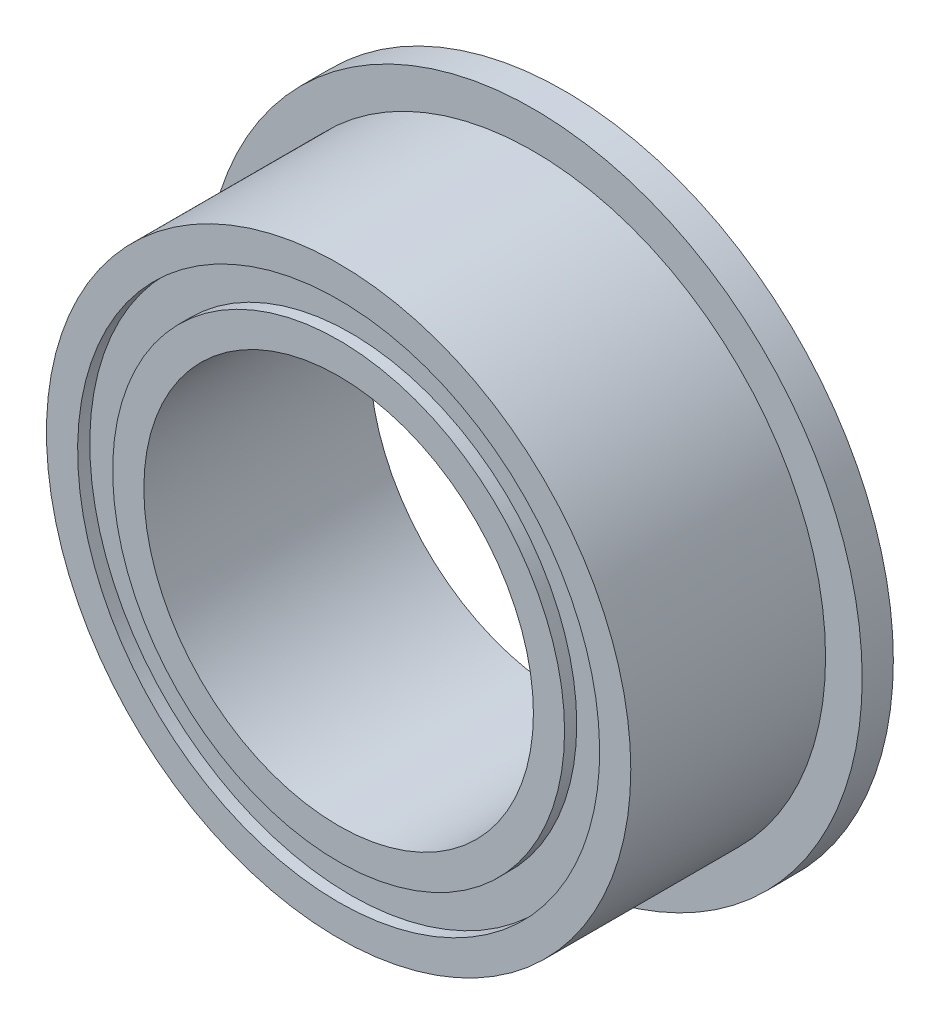
ISO-10303-21;
HEADER;
FILE_DESCRIPTION(('STEP AP214'),'2;1');
FILE_NAME('part.step','',(''),(''),'','','');
FILE_SCHEMA(('AUTOMOTIVE_DESIGN { 1 0 10303 214 1 1 1 1 }'));
ENDSEC;
DATA;
#1=APPLICATION_CONTEXT('core data for automotive mechanical design processes');
#2=APPLICATION_PROTOCOL_DEFINITION('international standard','automotive_design',2000,#1);
#3=PRODUCT_CONTEXT('',#1,'mechanical');
#4=PRODUCT('Part','Part','',(#3));
#5=PRODUCT_RELATED_PRODUCT_CATEGORY('part','',(#4));
#6=PRODUCT_DEFINITION_FORMATION('','',#4);
#7=PRODUCT_DEFINITION_CONTEXT('part definition',#1,'design');
#8=PRODUCT_DEFINITION('design','',#6,#7);
#9=PRODUCT_DEFINITION_SHAPE('','',#8);
#10=(LENGTH_UNIT() NAMED_UNIT(*) SI_UNIT(.MILLI.,.METRE.));
#11=(NAMED_UNIT(*) PLANE_ANGLE_UNIT() SI_UNIT($,.RADIAN.));
#12=(NAMED_UNIT(*) SI_UNIT($,.STERADIAN.) SOLID_ANGLE_UNIT());
#13=UNCERTAINTY_MEASURE_WITH_UNIT(LENGTH_MEASURE(1.E-05),#10,'distance_accuracy_value','');
#14=(GEOMETRIC_REPRESENTATION_CONTEXT(3) GLOBAL_UNCERTAINTY_ASSIGNED_CONTEXT((#13)) GLOBAL_UNIT_ASSIGNED_CONTEXT((#10,
#11,#12)) REPRESENTATION_CONTEXT('',''));
#15=CARTESIAN_POINT('',(0.,0.,0.));
#16=DIRECTION('',(0.,0.,1.));
#17=DIRECTION('',(1.,0.,0.));
#18=AXIS2_PLACEMENT_3D('',#15,#16,#17);
#19=CARTESIAN_POINT('',(0.,0.,-1.8415));
#20=DIRECTION('',(0.,0.,-1.));
#21=DIRECTION('',(0.,-1.,0.));
#22=AXIS2_PLACEMENT_3D('',#19,#20,#21);
#23=CYLINDRICAL_SURFACE('',#22,3.683);
#24=CARTESIAN_POINT('',(0.,0.,-1.6430625));
#25=DIRECTION('',(0.,0.,1.));
#26=DIRECTION('',(1.,0.,0.));
#27=AXIS2_PLACEMENT_3D('',#24,#25,#26);
#28=CIRCLE('',#27,3.683);
#29=CARTESIAN_POINT('',(3.683,0.,-1.6430625));
#30=VERTEX_POINT('',#29);
#31=EDGE_CURVE('E21',#30,#30,#28,.T.);
#32=ORIENTED_EDGE('',*,*,#31,.F.);
#33=EDGE_LOOP('',(#32));
#34=FACE_BOUND('',#33,.T.);
#35=CARTESIAN_POINT('',(0.,0.,-1.8415));
#36=DIRECTION('',(0.,0.,-1.));
#37=DIRECTION('',(0.,-1.,0.));
#38=AXIS2_PLACEMENT_3D('',#35,#36,#37);
#39=CIRCLE('',#38,3.683);
#40=CARTESIAN_POINT('',(0.,-3.683,-1.8415));
#41=VERTEX_POINT('',#40);
#42=EDGE_CURVE('E30',#41,#41,#39,.T.);
#43=ORIENTED_EDGE('',*,*,#42,.F.);
#44=EDGE_LOOP('',(#43));
#45=FACE_BOUND('',#44,.T.);
#46=ADVANCED_FACE('F13',(#34,#45),#23,.T.);
#47=CARTESIAN_POINT('',(0.,0.,-1.8415));
#48=DIRECTION('',(0.,0.,-1.));
#49=DIRECTION('',(0.,-1.,0.));
#50=AXIS2_PLACEMENT_3D('',#47,#48,#49);
#51=CYLINDRICAL_SURFACE('',#50,4.2545);
#52=CARTESIAN_POINT('',(0.,0.,-1.6430625));
#53=DIRECTION('',(0.,0.,1.));
#54=DIRECTION('',(1.,0.,0.));
#55=AXIS2_PLACEMENT_3D('',#52,#53,#54);
#56=CIRCLE('',#55,4.2545);
#57=CARTESIAN_POINT('',(4.2545,0.,-1.6430625));
#58=VERTEX_POINT('',#57);
#59=EDGE_CURVE('E8',#58,#58,#56,.T.);
#60=ORIENTED_EDGE('',*,*,#59,.T.);
#61=EDGE_LOOP('',(#60));
#62=FACE_BOUND('',#61,.T.);
#63=CARTESIAN_POINT('',(0.,0.,-1.8415));
#64=DIRECTION('',(0.,0.,1.));
#65=DIRECTION('',(1.,0.,0.));
#66=AXIS2_PLACEMENT_3D('',#63,#64,#65);
#67=CIRCLE('',#66,4.2545);
#68=CARTESIAN_POINT('',(4.2545,0.,-1.8415));
#69=VERTEX_POINT('',#68);
#70=EDGE_CURVE('E26',#69,#69,#67,.T.);
#71=ORIENTED_EDGE('',*,*,#70,.F.);
#72=EDGE_LOOP('',(#71));
#73=FACE_BOUND('',#72,.T.);
#74=ADVANCED_FACE('F66',(#62,#73),#51,.F.);
#75=CARTESIAN_POINT('',(0.,0.,-1.6430625));
#76=DIRECTION('',(0.,0.,1.));
#77=DIRECTION('',(1.,0.,0.));
#78=AXIS2_PLACEMENT_3D('',#75,#76,#77);
#79=PLANE('',#78);
#80=ORIENTED_EDGE('',*,*,#31,.T.);
#81=EDGE_LOOP('',(#80));
#82=FACE_BOUND('',#81,.T.);
#83=ORIENTED_EDGE('',*,*,#59,.F.);
#84=EDGE_LOOP('',(#83));
#85=FACE_BOUND('',#84,.T.);
#86=ADVANCED_FACE('F73',(#82,#85),#79,.F.);
#87=CARTESIAN_POINT('',(0.,0.,-1.8415));
#88=DIRECTION('',(0.,0.,-1.));
#89=DIRECTION('',(-1.,0.,0.));
#90=AXIS2_PLACEMENT_3D('',#87,#88,#89);
#91=PLANE('',#90);
#92=CARTESIAN_POINT('',(0.,0.,-1.8415));
#93=DIRECTION('',(0.,0.,1.));
#94=DIRECTION('',(1.,0.,0.));
#95=AXIS2_PLACEMENT_3D('',#92,#93,#94);
#96=CIRCLE('',#95,5.3594);
#97=CARTESIAN_POINT('',(5.3594,0.,-1.8415));
#98=VERTEX_POINT('',#97);
#99=EDGE_CURVE('E34',#98,#98,#96,.T.);
#100=ORIENTED_EDGE('',*,*,#99,.F.);
#101=EDGE_LOOP('',(#100));
#102=FACE_BOUND('',#101,.T.);
#103=ORIENTED_EDGE('',*,*,#70,.T.);
#104=EDGE_LOOP('',(#103));
#105=FACE_BOUND('',#104,.T.);
#106=ADVANCED_FACE('F77',(#102,#105),#91,.T.);
#107=CARTESIAN_POINT('',(0.,0.,1.8415));
#108=DIRECTION('',(0.,0.,-1.));
#109=DIRECTION('',(0.,-1.,0.));
#110=AXIS2_PLACEMENT_3D('',#107,#108,#109);
#111=CYLINDRICAL_SURFACE('',#110,3.683);
#112=CARTESIAN_POINT('',(0.,0.,1.6430625));
#113=DIRECTION('',(0.,0.,1.));
#114=DIRECTION('',(1.,0.,0.));
#115=AXIS2_PLACEMENT_3D('',#112,#113,#114);
#116=CIRCLE('',#115,3.683);
#117=CARTESIAN_POINT('',(3.683,0.,1.6430625));
#118=VERTEX_POINT('',#117);
#119=EDGE_CURVE('E33',#118,#118,#116,.T.);
#120=ORIENTED_EDGE('',*,*,#119,.T.);
#121=EDGE_LOOP('',(#120));
#122=FACE_BOUND('',#121,.T.);
#123=CARTESIAN_POINT('',(0.,0.,1.8415));
#124=DIRECTION('',(0.,0.,1.));
#125=DIRECTION('',(1.,0.,0.));
#126=AXIS2_PLACEMENT_3D('',#123,#124,#125);
#127=CIRCLE('',#126,3.683);
#128=CARTESIAN_POINT('',(3.683,0.,1.8415));
#129=VERTEX_POINT('',#128);
#130=EDGE_CURVE('E38',#129,#129,#127,.T.);
#131=ORIENTED_EDGE('',*,*,#130,.F.);
#132=EDGE_LOOP('',(#131));
#133=FACE_BOUND('',#132,.T.);
#134=ADVANCED_FACE('F80',(#122,#133),#111,.T.);
#135=CARTESIAN_POINT('',(0.,0.,1.8415));
#136=DIRECTION('',(0.,0.,-1.));
#137=DIRECTION('',(0.,-1.,0.));
#138=AXIS2_PLACEMENT_3D('',#135,#136,#137);
#139=CYLINDRICAL_SURFACE('',#138,4.2545);
#140=CARTESIAN_POINT('',(0.,0.,1.6430625));
#141=DIRECTION('',(0.,0.,1.));
#142=DIRECTION('',(1.,0.,0.));
#143=AXIS2_PLACEMENT_3D('',#140,#141,#142);
#144=CIRCLE('',#143,4.2545);
#145=CARTESIAN_POINT('',(4.2545,0.,1.6430625));
#146=VERTEX_POINT('',#145);
#147=EDGE_CURVE('E41',#146,#146,#144,.T.);
#148=ORIENTED_EDGE('',*,*,#147,.F.);
#149=EDGE_LOOP('',(#148));
#150=FACE_BOUND('',#149,.T.);
#151=CARTESIAN_POINT('',(0.,0.,1.8415));
#152=DIRECTION('',(0.,0.,-1.));
#153=DIRECTION('',(0.,-1.,0.));
#154=AXIS2_PLACEMENT_3D('',#151,#152,#153);
#155=CIRCLE('',#154,4.2545);
#156=CARTESIAN_POINT('',(0.,-4.2545,1.8415));
#157=VERTEX_POINT('',#156);
#158=EDGE_CURVE('E47',#157,#157,#155,.T.);
#159=ORIENTED_EDGE('',*,*,#158,.F.);
#160=EDGE_LOOP('',(#159));
#161=FACE_BOUND('',#160,.T.);
#162=ADVANCED_FACE('F86',(#150,#161),#139,.F.);
#163=CARTESIAN_POINT('',(0.,0.,1.6430625));
#164=DIRECTION('',(0.,0.,-1.));
#165=DIRECTION('',(-1.,0.,0.));
#166=AXIS2_PLACEMENT_3D('',#163,#164,#165);
#167=PLANE('',#166);
#168=ORIENTED_EDGE('',*,*,#119,.F.);
#169=EDGE_LOOP('',(#168));
#170=FACE_BOUND('',#169,.T.);
#171=ORIENTED_EDGE('',*,*,#147,.T.);
#172=EDGE_LOOP('',(#171));
#173=FACE_BOUND('',#172,.T.);
#174=ADVANCED_FACE('F82',(#170,#173),#167,.F.);
#175=CARTESIAN_POINT('',(0.,0.,1.8415));
#176=DIRECTION('',(0.,0.,-1.));
#177=DIRECTION('',(-1.,0.,0.));
#178=AXIS2_PLACEMENT_3D('',#175,#176,#177);
#179=PLANE('',#178);
#180=CARTESIAN_POINT('',(0.,0.,1.8415));
#181=DIRECTION('',(0.,0.,1.));
#182=DIRECTION('',(1.,0.,0.));
#183=AXIS2_PLACEMENT_3D('',#180,#181,#182);
#184=CIRCLE('',#183,4.7625);
#185=CARTESIAN_POINT('',(4.7625,0.,1.8415));
#186=VERTEX_POINT('',#185);
#187=EDGE_CURVE('E46',#186,#186,#184,.T.);
#188=ORIENTED_EDGE('',*,*,#187,.T.);
#189=EDGE_LOOP('',(#188));
#190=FACE_BOUND('',#189,.T.);
#191=ORIENTED_EDGE('',*,*,#158,.T.);
#192=EDGE_LOOP('',(#191));
#193=FACE_BOUND('',#192,.T.);
#194=ADVANCED_FACE('F85',(#190,#193),#179,.F.);
#195=CARTESIAN_POINT('',(0.,0.,1.8415));
#196=DIRECTION('',(0.,0.,-1.));
#197=DIRECTION('',(0.,-1.,0.));
#198=AXIS2_PLACEMENT_3D('',#195,#196,#197);
#199=CYLINDRICAL_SURFACE('',#198,4.7625);
#200=CARTESIAN_POINT('',(0.,0.,-1.3335));
#201=DIRECTION('',(0.,0.,1.));
#202=DIRECTION('',(1.,0.,0.));
#203=AXIS2_PLACEMENT_3D('',#200,#201,#202);
#204=CIRCLE('',#203,4.7625);
#205=CARTESIAN_POINT('',(4.7625,0.,-1.3335));
#206=VERTEX_POINT('',#205);
#207=EDGE_CURVE('E50',#206,#206,#204,.T.);
#208=ORIENTED_EDGE('',*,*,#207,.T.);
#209=EDGE_LOOP('',(#208));
#210=FACE_BOUND('',#209,.T.);
#211=ORIENTED_EDGE('',*,*,#187,.F.);
#212=EDGE_LOOP('',(#211));
#213=FACE_BOUND('',#212,.T.);
#214=ADVANCED_FACE('F90',(#210,#213),#199,.T.);
#215=CARTESIAN_POINT('',(0.,0.,-1.3335));
#216=DIRECTION('',(0.,0.,-1.));
#217=DIRECTION('',(-1.,0.,0.));
#218=AXIS2_PLACEMENT_3D('',#215,#216,#217);
#219=PLANE('',#218);
#220=ORIENTED_EDGE('',*,*,#207,.F.);
#221=EDGE_LOOP('',(#220));
#222=FACE_BOUND('',#221,.T.);
#223=CARTESIAN_POINT('',(0.,0.,-1.3335));
#224=DIRECTION('',(0.,0.,-1.));
#225=DIRECTION('',(0.,-1.,0.));
#226=AXIS2_PLACEMENT_3D('',#223,#224,#225);
#227=CIRCLE('',#226,5.3594);
#228=CARTESIAN_POINT('',(0.,-5.3594,-1.3335));
#229=VERTEX_POINT('',#228);
#230=EDGE_CURVE('E37',#229,#229,#227,.T.);
#231=ORIENTED_EDGE('',*,*,#230,.F.);
#232=EDGE_LOOP('',(#231));
#233=FACE_BOUND('',#232,.T.);
#234=ADVANCED_FACE('F92',(#222,#233),#219,.F.);
#235=CARTESIAN_POINT('',(0.,0.,0.));
#236=DIRECTION('',(0.,0.,1.));
#237=DIRECTION('',(1.,0.,0.));
#238=AXIS2_PLACEMENT_3D('',#235,#236,#237);
#239=CYLINDRICAL_SURFACE('',#238,3.175);
#240=CARTESIAN_POINT('',(0.,0.,-1.8415));
#241=DIRECTION('',(0.,0.,1.));
#242=DIRECTION('',(1.,0.,0.));
#243=AXIS2_PLACEMENT_3D('',#240,#241,#242);
#244=CIRCLE('',#243,3.175);
#245=CARTESIAN_POINT('',(3.175,0.,-1.8415));
#246=VERTEX_POINT('',#245);
#247=EDGE_CURVE('E56',#246,#246,#244,.T.);
#248=ORIENTED_EDGE('',*,*,#247,.F.);
#249=EDGE_LOOP('',(#248));
#250=FACE_BOUND('',#249,.T.);
#251=CARTESIAN_POINT('',(0.,0.,1.8415));
#252=DIRECTION('',(0.,0.,-1.));
#253=DIRECTION('',(0.,-1.,0.));
#254=AXIS2_PLACEMENT_3D('',#251,#252,#253);
#255=CIRCLE('',#254,3.175);
#256=CARTESIAN_POINT('',(0.,-3.175,1.8415));
#257=VERTEX_POINT('',#256);
#258=EDGE_CURVE('E17',#257,#257,#255,.T.);
#259=ORIENTED_EDGE('',*,*,#258,.F.);
#260=EDGE_LOOP('',(#259));
#261=FACE_BOUND('',#260,.T.);
#262=ADVANCED_FACE('F95',(#250,#261),#239,.F.);
#263=CARTESIAN_POINT('',(0.,0.,-1.8415));
#264=DIRECTION('',(0.,0.,-1.));
#265=DIRECTION('',(-1.,0.,0.));
#266=AXIS2_PLACEMENT_3D('',#263,#264,#265);
#267=PLANE('',#266);
#268=ORIENTED_EDGE('',*,*,#42,.T.);
#269=EDGE_LOOP('',(#268));
#270=FACE_BOUND('',#269,.T.);
#271=ORIENTED_EDGE('',*,*,#247,.T.);
#272=EDGE_LOOP('',(#271));
#273=FACE_BOUND('',#272,.T.);
#274=ADVANCED_FACE('F63',(#270,#273),#267,.T.);
#275=CARTESIAN_POINT('',(0.,0.,0.));
#276=DIRECTION('',(0.,0.,1.));
#277=DIRECTION('',(1.,0.,0.));
#278=AXIS2_PLACEMENT_3D('',#275,#276,#277);
#279=CYLINDRICAL_SURFACE('',#278,5.3594);
#280=ORIENTED_EDGE('',*,*,#230,.T.);
#281=EDGE_LOOP('',(#280));
#282=FACE_BOUND('',#281,.T.);
#283=ORIENTED_EDGE('',*,*,#99,.T.);
#284=EDGE_LOOP('',(#283));
#285=FACE_BOUND('',#284,.T.);
#286=ADVANCED_FACE('F15',(#282,#285),#279,.T.);
#287=CARTESIAN_POINT('',(0.,0.,1.8415));
#288=DIRECTION('',(0.,0.,-1.));
#289=DIRECTION('',(-1.,0.,0.));
#290=AXIS2_PLACEMENT_3D('',#287,#288,#289);
#291=PLANE('',#290);
#292=ORIENTED_EDGE('',*,*,#130,.T.);
#293=EDGE_LOOP('',(#292));
#294=FACE_BOUND('',#293,.T.);
#295=ORIENTED_EDGE('',*,*,#258,.T.);
#296=EDGE_LOOP('',(#295));
#297=FACE_BOUND('',#296,.T.);
#298=ADVANCED_FACE('F99',(#294,#297),#291,.F.);
#299=CLOSED_SHELL('',(#46,#74,#86,#106,#134,#162,#174,#194,#214,#234,#262,#274,#286,#298));
#300=MANIFOLD_SOLID_BREP('B1',#299);
#301=ADVANCED_BREP_SHAPE_REPRESENTATION('',(#18,#300),#14);
#302=SHAPE_DEFINITION_REPRESENTATION(#9,#301);
ENDSEC;
END-ISO-10303-21;
